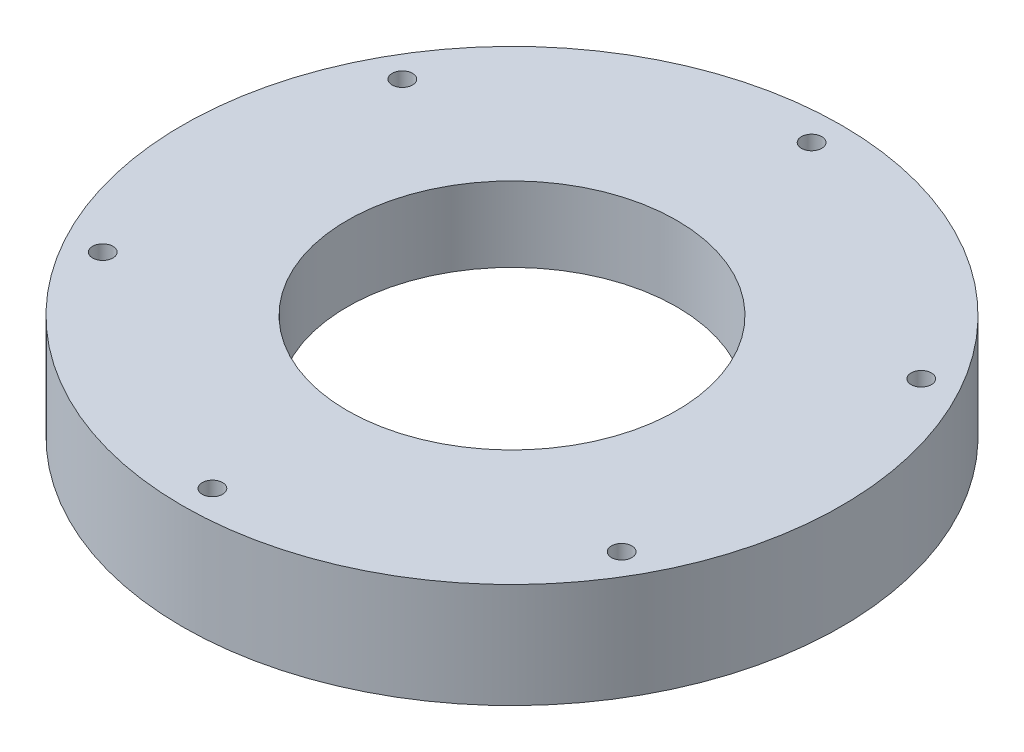
ISO-10303-21;
HEADER;
FILE_DESCRIPTION(('STEP AP214'),'2;1');
FILE_NAME('part.step','',(''),(''),'','','');
FILE_SCHEMA(('AUTOMOTIVE_DESIGN { 1 0 10303 214 1 1 1 1 }'));
ENDSEC;
DATA;
#1=APPLICATION_CONTEXT('core data for automotive mechanical design processes');
#2=APPLICATION_PROTOCOL_DEFINITION('international standard','automotive_design',2000,#1);
#3=PRODUCT_CONTEXT('',#1,'mechanical');
#4=PRODUCT('Part','Part','',(#3));
#5=PRODUCT_RELATED_PRODUCT_CATEGORY('part','',(#4));
#6=PRODUCT_DEFINITION_FORMATION('','',#4);
#7=PRODUCT_DEFINITION_CONTEXT('part definition',#1,'design');
#8=PRODUCT_DEFINITION('design','',#6,#7);
#9=PRODUCT_DEFINITION_SHAPE('','',#8);
#10=(LENGTH_UNIT() NAMED_UNIT(*) SI_UNIT(.MILLI.,.METRE.));
#11=(NAMED_UNIT(*) PLANE_ANGLE_UNIT() SI_UNIT($,.RADIAN.));
#12=(NAMED_UNIT(*) SI_UNIT($,.STERADIAN.) SOLID_ANGLE_UNIT());
#13=UNCERTAINTY_MEASURE_WITH_UNIT(LENGTH_MEASURE(1.E-05),#10,'distance_accuracy_value','');
#14=(GEOMETRIC_REPRESENTATION_CONTEXT(3) GLOBAL_UNCERTAINTY_ASSIGNED_CONTEXT((#13)) GLOBAL_UNIT_ASSIGNED_CONTEXT((#10,
#11,#12)) REPRESENTATION_CONTEXT('',''));
#15=CARTESIAN_POINT('',(0.,0.,0.));
#16=DIRECTION('',(0.,0.,1.));
#17=DIRECTION('',(1.,0.,0.));
#18=AXIS2_PLACEMENT_3D('',#15,#16,#17);
#19=CARTESIAN_POINT('',(0.,35.,0.));
#20=DIRECTION('',(0.,-1.,0.));
#21=DIRECTION('',(0.,0.,-1.));
#22=AXIS2_PLACEMENT_3D('',#19,#20,#21);
#23=CYLINDRICAL_SURFACE('',#22,55.);
#24=CARTESIAN_POINT('',(0.,35.,0.));
#25=DIRECTION('',(0.,1.,0.));
#26=DIRECTION('',(0.,0.,1.));
#27=AXIS2_PLACEMENT_3D('',#24,#25,#26);
#28=CIRCLE('',#27,55.);
#29=CARTESIAN_POINT('',(0.,35.,55.));
#30=VERTEX_POINT('',#29);
#31=EDGE_CURVE('E45',#30,#30,#28,.T.);
#32=ORIENTED_EDGE('',*,*,#31,.T.);
#33=EDGE_LOOP('',(#32));
#34=FACE_BOUND('',#33,.T.);
#35=CARTESIAN_POINT('',(0.,10.,0.));
#36=DIRECTION('',(0.,-1.,0.));
#37=DIRECTION('',(0.,0.,-1.));
#38=AXIS2_PLACEMENT_3D('',#35,#36,#37);
#39=CIRCLE('',#38,55.);
#40=CARTESIAN_POINT('',(0.,10.,-55.));
#41=VERTEX_POINT('',#40);
#42=EDGE_CURVE('E36',#41,#41,#39,.T.);
#43=ORIENTED_EDGE('',*,*,#42,.T.);
#44=EDGE_LOOP('',(#43));
#45=FACE_BOUND('',#44,.T.);
#46=ADVANCED_FACE('F32',(#34,#45),#23,.F.);
#47=CARTESIAN_POINT('',(0.,35.,0.));
#48=DIRECTION('',(0.,1.,0.));
#49=DIRECTION('',(0.,0.,1.));
#50=AXIS2_PLACEMENT_3D('',#47,#48,#49);
#51=PLANE('',#50);
#52=CARTESIAN_POINT('',(-86.6025403784354,35.,50.));
#53=DIRECTION('',(0.,1.,0.));
#54=DIRECTION('',(0.,0.,1.));
#55=AXIS2_PLACEMENT_3D('',#52,#53,#54);
#56=CIRCLE('',#55,3.4);
#57=CARTESIAN_POINT('',(-86.6025403784354,35.,53.4));
#58=VERTEX_POINT('',#57);
#59=EDGE_CURVE('E71',#58,#58,#56,.T.);
#60=ORIENTED_EDGE('',*,*,#59,.F.);
#61=EDGE_LOOP('',(#60));
#62=FACE_BOUND('',#61,.T.);
#63=CARTESIAN_POINT('',(86.6025403784481,35.,49.9999999999926));
#64=DIRECTION('',(0.,1.,0.));
#65=DIRECTION('',(0.,0.,1.));
#66=AXIS2_PLACEMENT_3D('',#63,#64,#65);
#67=CIRCLE('',#66,3.4);
#68=CARTESIAN_POINT('',(86.6025403784481,35.,53.3999999999926));
#69=VERTEX_POINT('',#68);
#70=EDGE_CURVE('E59',#69,#69,#67,.T.);
#71=ORIENTED_EDGE('',*,*,#70,.F.);
#72=EDGE_LOOP('',(#71));
#73=FACE_BOUND('',#72,.T.);
#74=CARTESIAN_POINT('',(0.,35.,-100.));
#75=DIRECTION('',(0.,1.,0.));
#76=DIRECTION('',(0.,0.,1.));
#77=AXIS2_PLACEMENT_3D('',#74,#75,#76);
#78=CIRCLE('',#77,3.4);
#79=CARTESIAN_POINT('',(0.,35.,-96.6));
#80=VERTEX_POINT('',#79);
#81=EDGE_CURVE('E49',#80,#80,#78,.T.);
#82=ORIENTED_EDGE('',*,*,#81,.F.);
#83=EDGE_LOOP('',(#82));
#84=FACE_BOUND('',#83,.T.);
#85=CARTESIAN_POINT('',(0.,35.,0.));
#86=DIRECTION('',(0.,1.,0.));
#87=DIRECTION('',(0.,0.,1.));
#88=AXIS2_PLACEMENT_3D('',#85,#86,#87);
#89=CIRCLE('',#88,110.);
#90=CARTESIAN_POINT('',(0.,35.,110.));
#91=VERTEX_POINT('',#90);
#92=EDGE_CURVE('E10',#91,#91,#89,.T.);
#93=ORIENTED_EDGE('',*,*,#92,.T.);
#94=EDGE_LOOP('',(#93));
#95=FACE_BOUND('',#94,.T.);
#96=ORIENTED_EDGE('',*,*,#31,.F.);
#97=EDGE_LOOP('',(#96));
#98=FACE_BOUND('',#97,.T.);
#99=CARTESIAN_POINT('',(86.6025403784438,35.,-50.0000000000049));
#100=DIRECTION('',(0.,1.,0.));
#101=DIRECTION('',(0.,0.,1.));
#102=AXIS2_PLACEMENT_3D('',#99,#100,#101);
#103=CIRCLE('',#102,3.4);
#104=CARTESIAN_POINT('',(86.6025403784438,35.,-46.6000000000049));
#105=VERTEX_POINT('',#104);
#106=EDGE_CURVE('E53',#105,#105,#103,.T.);
#107=ORIENTED_EDGE('',*,*,#106,.F.);
#108=EDGE_LOOP('',(#107));
#109=FACE_BOUND('',#108,.T.);
#110=CARTESIAN_POINT('',(8.4610436853887E-12,35.,99.999999999995));
#111=DIRECTION('',(0.,1.,0.));
#112=DIRECTION('',(0.,0.,1.));
#113=AXIS2_PLACEMENT_3D('',#110,#111,#112);
#114=CIRCLE('',#113,3.4);
#115=CARTESIAN_POINT('',(8.4610436853887E-12,35.,103.399999999995));
#116=VERTEX_POINT('',#115);
#117=EDGE_CURVE('E65',#116,#116,#114,.T.);
#118=ORIENTED_EDGE('',*,*,#117,.F.);
#119=EDGE_LOOP('',(#118));
#120=FACE_BOUND('',#119,.T.);
#121=CARTESIAN_POINT('',(-86.6025403784396,35.,-49.9999999999976));
#122=DIRECTION('',(0.,1.,0.));
#123=DIRECTION('',(0.,0.,1.));
#124=AXIS2_PLACEMENT_3D('',#121,#122,#123);
#125=CIRCLE('',#124,3.4);
#126=CARTESIAN_POINT('',(-86.6025403784396,35.,-46.5999999999976));
#127=VERTEX_POINT('',#126);
#128=EDGE_CURVE('E77',#127,#127,#125,.T.);
#129=ORIENTED_EDGE('',*,*,#128,.F.);
#130=EDGE_LOOP('',(#129));
#131=FACE_BOUND('',#130,.T.);
#132=ADVANCED_FACE('F107',(#62,#73,#84,#95,#98,#109,#120,#131),#51,.T.);
#133=CARTESIAN_POINT('',(0.,0.,0.));
#134=DIRECTION('',(0.,1.,0.));
#135=DIRECTION('',(0.,0.,1.));
#136=AXIS2_PLACEMENT_3D('',#133,#134,#135);
#137=PLANE('',#136);
#138=CARTESIAN_POINT('',(0.,0.,0.));
#139=DIRECTION('',(0.,-1.,0.));
#140=DIRECTION('',(0.,0.,-1.));
#141=AXIS2_PLACEMENT_3D('',#138,#139,#140);
#142=CIRCLE('',#141,87.5);
#143=CARTESIAN_POINT('',(0.,0.,-87.5));
#144=VERTEX_POINT('',#143);
#145=EDGE_CURVE('E85',#144,#144,#142,.T.);
#146=ORIENTED_EDGE('',*,*,#145,.F.);
#147=EDGE_LOOP('',(#146));
#148=FACE_BOUND('',#147,.T.);
#149=CARTESIAN_POINT('',(0.,0.,0.));
#150=DIRECTION('',(0.,1.,0.));
#151=DIRECTION('',(0.,0.,1.));
#152=AXIS2_PLACEMENT_3D('',#149,#150,#151);
#153=CIRCLE('',#152,110.);
#154=CARTESIAN_POINT('',(0.,0.,110.));
#155=VERTEX_POINT('',#154);
#156=EDGE_CURVE('E40',#155,#155,#153,.T.);
#157=ORIENTED_EDGE('',*,*,#156,.F.);
#158=EDGE_LOOP('',(#157));
#159=FACE_BOUND('',#158,.T.);
#160=CARTESIAN_POINT('',(0.,0.,-100.));
#161=DIRECTION('',(0.,1.,0.));
#162=DIRECTION('',(0.,0.,1.));
#163=AXIS2_PLACEMENT_3D('',#160,#161,#162);
#164=CIRCLE('',#163,3.4);
#165=CARTESIAN_POINT('',(0.,0.,-96.6));
#166=VERTEX_POINT('',#165);
#167=EDGE_CURVE('E50',#166,#166,#164,.T.);
#168=ORIENTED_EDGE('',*,*,#167,.T.);
#169=EDGE_LOOP('',(#168));
#170=FACE_BOUND('',#169,.T.);
#171=CARTESIAN_POINT('',(86.6025403784438,0.,-50.0000000000049));
#172=DIRECTION('',(0.,1.,0.));
#173=DIRECTION('',(0.,0.,1.));
#174=AXIS2_PLACEMENT_3D('',#171,#172,#173);
#175=CIRCLE('',#174,3.4);
#176=CARTESIAN_POINT('',(86.6025403784438,0.,-46.6000000000049));
#177=VERTEX_POINT('',#176);
#178=EDGE_CURVE('E56',#177,#177,#175,.T.);
#179=ORIENTED_EDGE('',*,*,#178,.T.);
#180=EDGE_LOOP('',(#179));
#181=FACE_BOUND('',#180,.T.);
#182=CARTESIAN_POINT('',(86.6025403784481,0.,49.9999999999926));
#183=DIRECTION('',(0.,1.,0.));
#184=DIRECTION('',(0.,0.,1.));
#185=AXIS2_PLACEMENT_3D('',#182,#183,#184);
#186=CIRCLE('',#185,3.4);
#187=CARTESIAN_POINT('',(86.6025403784481,0.,53.3999999999926));
#188=VERTEX_POINT('',#187);
#189=EDGE_CURVE('E62',#188,#188,#186,.T.);
#190=ORIENTED_EDGE('',*,*,#189,.T.);
#191=EDGE_LOOP('',(#190));
#192=FACE_BOUND('',#191,.T.);
#193=CARTESIAN_POINT('',(8.4610436853887E-12,0.,99.999999999995));
#194=DIRECTION('',(0.,1.,0.));
#195=DIRECTION('',(0.,0.,1.));
#196=AXIS2_PLACEMENT_3D('',#193,#194,#195);
#197=CIRCLE('',#196,3.4);
#198=CARTESIAN_POINT('',(8.4610436853887E-12,0.,103.399999999995));
#199=VERTEX_POINT('',#198);
#200=EDGE_CURVE('E68',#199,#199,#197,.T.);
#201=ORIENTED_EDGE('',*,*,#200,.T.);
#202=EDGE_LOOP('',(#201));
#203=FACE_BOUND('',#202,.T.);
#204=CARTESIAN_POINT('',(-86.6025403784354,0.,50.));
#205=DIRECTION('',(0.,1.,0.));
#206=DIRECTION('',(0.,0.,1.));
#207=AXIS2_PLACEMENT_3D('',#204,#205,#206);
#208=CIRCLE('',#207,3.4);
#209=CARTESIAN_POINT('',(-86.6025403784354,0.,53.4));
#210=VERTEX_POINT('',#209);
#211=EDGE_CURVE('E74',#210,#210,#208,.T.);
#212=ORIENTED_EDGE('',*,*,#211,.T.);
#213=EDGE_LOOP('',(#212));
#214=FACE_BOUND('',#213,.T.);
#215=CARTESIAN_POINT('',(-86.6025403784396,0.,-49.9999999999976));
#216=DIRECTION('',(0.,1.,0.));
#217=DIRECTION('',(0.,0.,1.));
#218=AXIS2_PLACEMENT_3D('',#215,#216,#217);
#219=CIRCLE('',#218,3.4);
#220=CARTESIAN_POINT('',(-86.6025403784396,0.,-46.5999999999976));
#221=VERTEX_POINT('',#220);
#222=EDGE_CURVE('E80',#221,#221,#219,.T.);
#223=ORIENTED_EDGE('',*,*,#222,.T.);
#224=EDGE_LOOP('',(#223));
#225=FACE_BOUND('',#224,.T.);
#226=ADVANCED_FACE('F113',(#148,#159,#170,#181,#192,#203,#214,#225),#137,.F.);
#227=CARTESIAN_POINT('',(0.,35.,0.));
#228=DIRECTION('',(0.,-1.,0.));
#229=DIRECTION('',(0.,0.,-1.));
#230=AXIS2_PLACEMENT_3D('',#227,#228,#229);
#231=CYLINDRICAL_SURFACE('',#230,110.);
#232=ORIENTED_EDGE('',*,*,#92,.F.);
#233=EDGE_LOOP('',(#232));
#234=FACE_BOUND('',#233,.T.);
#235=ORIENTED_EDGE('',*,*,#156,.T.);
#236=EDGE_LOOP('',(#235));
#237=FACE_BOUND('',#236,.T.);
#238=ADVANCED_FACE('F34',(#234,#237),#231,.T.);
#239=CARTESIAN_POINT('',(0.,35.,-100.));
#240=DIRECTION('',(0.,-1.,0.));
#241=DIRECTION('',(0.,0.,-1.));
#242=AXIS2_PLACEMENT_3D('',#239,#240,#241);
#243=CYLINDRICAL_SURFACE('',#242,3.4);
#244=ORIENTED_EDGE('',*,*,#81,.T.);
#245=EDGE_LOOP('',(#244));
#246=FACE_BOUND('',#245,.T.);
#247=ORIENTED_EDGE('',*,*,#167,.F.);
#248=EDGE_LOOP('',(#247));
#249=FACE_BOUND('',#248,.T.);
#250=ADVANCED_FACE('F117',(#246,#249),#243,.F.);
#251=CARTESIAN_POINT('',(86.6025403784438,35.,-50.0000000000049));
#252=DIRECTION('',(0.,-1.,0.));
#253=DIRECTION('',(0.,0.,-1.));
#254=AXIS2_PLACEMENT_3D('',#251,#252,#253);
#255=CYLINDRICAL_SURFACE('',#254,3.4);
#256=ORIENTED_EDGE('',*,*,#106,.T.);
#257=EDGE_LOOP('',(#256));
#258=FACE_BOUND('',#257,.T.);
#259=ORIENTED_EDGE('',*,*,#178,.F.);
#260=EDGE_LOOP('',(#259));
#261=FACE_BOUND('',#260,.T.);
#262=ADVANCED_FACE('F157',(#258,#261),#255,.F.);
#263=CARTESIAN_POINT('',(86.6025403784481,35.,49.9999999999926));
#264=DIRECTION('',(0.,-1.,0.));
#265=DIRECTION('',(0.,0.,-1.));
#266=AXIS2_PLACEMENT_3D('',#263,#264,#265);
#267=CYLINDRICAL_SURFACE('',#266,3.4);
#268=ORIENTED_EDGE('',*,*,#70,.T.);
#269=EDGE_LOOP('',(#268));
#270=FACE_BOUND('',#269,.T.);
#271=ORIENTED_EDGE('',*,*,#189,.F.);
#272=EDGE_LOOP('',(#271));
#273=FACE_BOUND('',#272,.T.);
#274=ADVANCED_FACE('F154',(#270,#273),#267,.F.);
#275=CARTESIAN_POINT('',(8.4610436853887E-12,35.,99.999999999995));
#276=DIRECTION('',(0.,-1.,0.));
#277=DIRECTION('',(0.,0.,-1.));
#278=AXIS2_PLACEMENT_3D('',#275,#276,#277);
#279=CYLINDRICAL_SURFACE('',#278,3.4);
#280=ORIENTED_EDGE('',*,*,#117,.T.);
#281=EDGE_LOOP('',(#280));
#282=FACE_BOUND('',#281,.T.);
#283=ORIENTED_EDGE('',*,*,#200,.F.);
#284=EDGE_LOOP('',(#283));
#285=FACE_BOUND('',#284,.T.);
#286=ADVANCED_FACE('F148',(#282,#285),#279,.F.);
#287=CARTESIAN_POINT('',(-86.6025403784354,35.,50.));
#288=DIRECTION('',(0.,-1.,0.));
#289=DIRECTION('',(0.,0.,-1.));
#290=AXIS2_PLACEMENT_3D('',#287,#288,#289);
#291=CYLINDRICAL_SURFACE('',#290,3.4);
#292=ORIENTED_EDGE('',*,*,#59,.T.);
#293=EDGE_LOOP('',(#292));
#294=FACE_BOUND('',#293,.T.);
#295=ORIENTED_EDGE('',*,*,#211,.F.);
#296=EDGE_LOOP('',(#295));
#297=FACE_BOUND('',#296,.T.);
#298=ADVANCED_FACE('F142',(#294,#297),#291,.F.);
#299=CARTESIAN_POINT('',(-86.6025403784396,35.,-49.9999999999976));
#300=DIRECTION('',(0.,-1.,0.));
#301=DIRECTION('',(0.,0.,-1.));
#302=AXIS2_PLACEMENT_3D('',#299,#300,#301);
#303=CYLINDRICAL_SURFACE('',#302,3.4);
#304=ORIENTED_EDGE('',*,*,#128,.T.);
#305=EDGE_LOOP('',(#304));
#306=FACE_BOUND('',#305,.T.);
#307=ORIENTED_EDGE('',*,*,#222,.F.);
#308=EDGE_LOOP('',(#307));
#309=FACE_BOUND('',#308,.T.);
#310=ADVANCED_FACE('F103',(#306,#309),#303,.F.);
#311=CARTESIAN_POINT('',(0.,10.,0.));
#312=DIRECTION('',(0.,-1.,0.));
#313=DIRECTION('',(0.,0.,-1.));
#314=AXIS2_PLACEMENT_3D('',#311,#312,#313);
#315=CYLINDRICAL_SURFACE('',#314,87.5);
#316=CARTESIAN_POINT('',(0.,10.,0.));
#317=DIRECTION('',(0.,-1.,0.));
#318=DIRECTION('',(0.,0.,-1.));
#319=AXIS2_PLACEMENT_3D('',#316,#317,#318);
#320=CIRCLE('',#319,87.5);
#321=CARTESIAN_POINT('',(0.,10.,-87.5));
#322=VERTEX_POINT('',#321);
#323=EDGE_CURVE('E88',#322,#322,#320,.T.);
#324=ORIENTED_EDGE('',*,*,#323,.F.);
#325=EDGE_LOOP('',(#324));
#326=FACE_BOUND('',#325,.T.);
#327=ORIENTED_EDGE('',*,*,#145,.T.);
#328=EDGE_LOOP('',(#327));
#329=FACE_BOUND('',#328,.T.);
#330=ADVANCED_FACE('F98',(#326,#329),#315,.F.);
#331=CARTESIAN_POINT('',(0.,10.,0.));
#332=DIRECTION('',(0.,-1.,0.));
#333=DIRECTION('',(0.,0.,-1.));
#334=AXIS2_PLACEMENT_3D('',#331,#332,#333);
#335=PLANE('',#334);
#336=ORIENTED_EDGE('',*,*,#42,.F.);
#337=EDGE_LOOP('',(#336));
#338=FACE_BOUND('',#337,.T.);
#339=ORIENTED_EDGE('',*,*,#323,.T.);
#340=EDGE_LOOP('',(#339));
#341=FACE_BOUND('',#340,.T.);
#342=ADVANCED_FACE('F96',(#338,#341),#335,.T.);
#343=CLOSED_SHELL('',(#46,#132,#226,#238,#250,#262,#274,#286,#298,#310,#330,#342));
#344=MANIFOLD_SOLID_BREP('B2',#343);
#345=ADVANCED_BREP_SHAPE_REPRESENTATION('',(#18,#344),#14);
#346=SHAPE_DEFINITION_REPRESENTATION(#9,#345);
ENDSEC;
END-ISO-10303-21;
